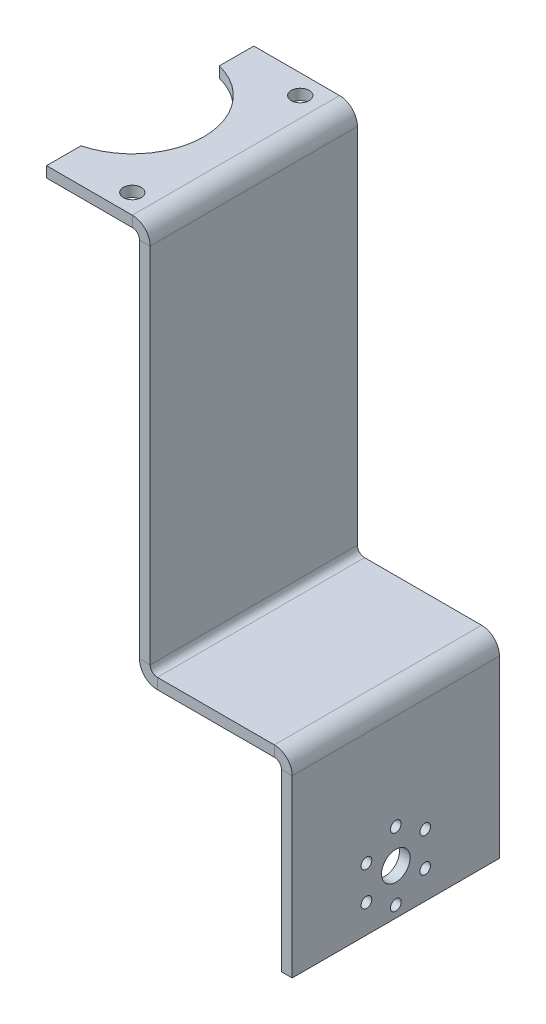
ISO-10303-21;
HEADER;
FILE_DESCRIPTION(('STEP AP214'),'2;1');
FILE_NAME('part.step','',(''),(''),'','','');
FILE_SCHEMA(('AUTOMOTIVE_DESIGN { 1 0 10303 214 1 1 1 1 }'));
ENDSEC;
DATA;
#1=APPLICATION_CONTEXT('core data for automotive mechanical design processes');
#2=APPLICATION_PROTOCOL_DEFINITION('international standard','automotive_design',2000,#1);
#3=PRODUCT_CONTEXT('',#1,'mechanical');
#4=PRODUCT('Part','Part','',(#3));
#5=PRODUCT_RELATED_PRODUCT_CATEGORY('part','',(#4));
#6=PRODUCT_DEFINITION_FORMATION('','',#4);
#7=PRODUCT_DEFINITION_CONTEXT('part definition',#1,'design');
#8=PRODUCT_DEFINITION('design','',#6,#7);
#9=PRODUCT_DEFINITION_SHAPE('','',#8);
#10=(LENGTH_UNIT() NAMED_UNIT(*) SI_UNIT(.MILLI.,.METRE.));
#11=(NAMED_UNIT(*) PLANE_ANGLE_UNIT() SI_UNIT($,.RADIAN.));
#12=(NAMED_UNIT(*) SI_UNIT($,.STERADIAN.) SOLID_ANGLE_UNIT());
#13=UNCERTAINTY_MEASURE_WITH_UNIT(LENGTH_MEASURE(1.E-05),#10,'distance_accuracy_value','');
#14=(GEOMETRIC_REPRESENTATION_CONTEXT(3) GLOBAL_UNCERTAINTY_ASSIGNED_CONTEXT((#13)) GLOBAL_UNIT_ASSIGNED_CONTEXT((#10,
#11,#12)) REPRESENTATION_CONTEXT('',''));
#15=CARTESIAN_POINT('',(0.,0.,0.));
#16=DIRECTION('',(0.,0.,1.));
#17=DIRECTION('',(1.,0.,0.));
#18=AXIS2_PLACEMENT_3D('',#15,#16,#17);
#19=CARTESIAN_POINT('',(0.,-3.,29.));
#20=DIRECTION('',(0.,1.,0.));
#21=DIRECTION('',(0.,0.,1.));
#22=AXIS2_PLACEMENT_3D('',#19,#20,#21);
#23=CYLINDRICAL_SURFACE('',#22,20.);
#24=CARTESIAN_POINT('',(0.,0.,29.));
#25=DIRECTION('',(0.,1.,0.));
#26=DIRECTION('',(0.,0.,1.));
#27=AXIS2_PLACEMENT_3D('',#24,#25,#26);
#28=CIRCLE('',#27,20.);
#29=CARTESIAN_POINT('',(5.,0.,48.3649167310371));
#30=VERTEX_POINT('',#29);
#31=CARTESIAN_POINT('',(5.,0.,9.63508326896292));
#32=VERTEX_POINT('',#31);
#33=EDGE_CURVE('E177',#30,#32,#28,.T.);
#34=ORIENTED_EDGE('',*,*,#33,.T.);
#35=DIRECTION('',(0.,-1.,0.));
#36=VECTOR('',#35,1.);
#37=CARTESIAN_POINT('',(5.,-3.,9.63508326896292));
#38=LINE('',#37,#36);
#39=CARTESIAN_POINT('',(5.,-3.,9.63508326896292));
#40=VERTEX_POINT('',#39);
#41=EDGE_CURVE('E162',#40,#32,#38,.F.);
#42=ORIENTED_EDGE('',*,*,#41,.F.);
#43=CARTESIAN_POINT('',(0.,-3.,29.));
#44=DIRECTION('',(0.,1.,0.));
#45=DIRECTION('',(0.,0.,1.));
#46=AXIS2_PLACEMENT_3D('',#43,#44,#45);
#47=CIRCLE('',#46,20.);
#48=CARTESIAN_POINT('',(5.,-3.,48.3649167310371));
#49=VERTEX_POINT('',#48);
#50=EDGE_CURVE('E319',#49,#40,#47,.T.);
#51=ORIENTED_EDGE('',*,*,#50,.F.);
#52=DIRECTION('',(0.,1.,0.));
#53=VECTOR('',#52,1.);
#54=CARTESIAN_POINT('',(5.,0.,48.3649167310371));
#55=LINE('',#54,#53);
#56=EDGE_CURVE('E62',#30,#49,#55,.F.);
#57=ORIENTED_EDGE('',*,*,#56,.F.);
#58=EDGE_LOOP('',(#34,#42,#51,#57));
#59=FACE_BOUND('',#58,.T.);
#60=ADVANCED_FACE('F39',(#59),#23,.F.);
#61=CARTESIAN_POINT('',(0.,0.,58.));
#62=DIRECTION('',(0.,1.,0.));
#63=DIRECTION('',(0.,0.,1.));
#64=AXIS2_PLACEMENT_3D('',#61,#62,#63);
#65=PLANE('',#64);
#66=CARTESIAN_POINT('',(23.5,0.,52.5));
#67=DIRECTION('',(0.,1.,0.));
#68=DIRECTION('',(0.,0.,1.));
#69=AXIS2_PLACEMENT_3D('',#66,#67,#68);
#70=CIRCLE('',#69,2.5);
#71=CARTESIAN_POINT('',(23.5,0.,55.));
#72=VERTEX_POINT('',#71);
#73=EDGE_CURVE('E185',#72,#72,#70,.T.);
#74=ORIENTED_EDGE('',*,*,#73,.F.);
#75=EDGE_LOOP('',(#74));
#76=FACE_BOUND('',#75,.T.);
#77=CARTESIAN_POINT('',(23.5,0.,5.5));
#78=DIRECTION('',(0.,1.,0.));
#79=DIRECTION('',(0.,0.,1.));
#80=AXIS2_PLACEMENT_3D('',#77,#78,#79);
#81=CIRCLE('',#80,2.5);
#82=CARTESIAN_POINT('',(23.5,0.,8.));
#83=VERTEX_POINT('',#82);
#84=EDGE_CURVE('E181',#83,#83,#81,.T.);
#85=ORIENTED_EDGE('',*,*,#84,.F.);
#86=EDGE_LOOP('',(#85));
#87=FACE_BOUND('',#86,.T.);
#88=DIRECTION('',(1.,0.,0.));
#89=VECTOR('',#88,1.);
#90=CARTESIAN_POINT('',(0.,0.,0.));
#91=LINE('',#90,#89);
#92=CARTESIAN_POINT('',(5.,0.,0.));
#93=VERTEX_POINT('',#92);
#94=CARTESIAN_POINT('',(29.,0.,0.));
#95=VERTEX_POINT('',#94);
#96=EDGE_CURVE('E179',#93,#95,#91,.T.);
#97=ORIENTED_EDGE('',*,*,#96,.F.);
#98=DIRECTION('',(0.,0.,1.));
#99=VECTOR('',#98,1.);
#100=CARTESIAN_POINT('',(5.,0.,58.));
#101=LINE('',#100,#99);
#102=EDGE_CURVE('E54',#32,#93,#101,.F.);
#103=ORIENTED_EDGE('',*,*,#102,.F.);
#104=ORIENTED_EDGE('',*,*,#33,.F.);
#105=DIRECTION('',(0.,0.,1.));
#106=VECTOR('',#105,1.);
#107=CARTESIAN_POINT('',(5.,0.,-13.));
#108=LINE('',#107,#106);
#109=CARTESIAN_POINT('',(5.,0.,58.));
#110=VERTEX_POINT('',#109);
#111=EDGE_CURVE('E933',#30,#110,#108,.T.);
#112=ORIENTED_EDGE('',*,*,#111,.T.);
#113=DIRECTION('',(1.,0.,0.));
#114=VECTOR('',#113,1.);
#115=CARTESIAN_POINT('',(0.,0.,58.));
#116=LINE('',#115,#114);
#117=CARTESIAN_POINT('',(29.,0.,58.));
#118=VERTEX_POINT('',#117);
#119=EDGE_CURVE('E334',#110,#118,#116,.T.);
#120=ORIENTED_EDGE('',*,*,#119,.T.);
#121=DIRECTION('',(0.,0.,1.));
#122=VECTOR('',#121,1.);
#123=CARTESIAN_POINT('',(29.,0.,58.));
#124=LINE('',#123,#122);
#125=EDGE_CURVE('E308',#95,#118,#124,.T.);
#126=ORIENTED_EDGE('',*,*,#125,.F.);
#127=EDGE_LOOP('',(#97,#103,#104,#112,#120,#126));
#128=FACE_BOUND('',#127,.T.);
#129=ADVANCED_FACE('F175',(#76,#87,#128),#65,.T.);
#130=CARTESIAN_POINT('',(0.,-3.,58.));
#131=DIRECTION('',(0.,1.,0.));
#132=DIRECTION('',(0.,0.,1.));
#133=AXIS2_PLACEMENT_3D('',#130,#131,#132);
#134=PLANE('',#133);
#135=CARTESIAN_POINT('',(23.5,-3.,52.5));
#136=DIRECTION('',(0.,1.,0.));
#137=DIRECTION('',(0.,0.,1.));
#138=AXIS2_PLACEMENT_3D('',#135,#136,#137);
#139=CIRCLE('',#138,2.5);
#140=CARTESIAN_POINT('',(23.5,-3.,55.));
#141=VERTEX_POINT('',#140);
#142=EDGE_CURVE('E329',#141,#141,#139,.T.);
#143=ORIENTED_EDGE('',*,*,#142,.T.);
#144=EDGE_LOOP('',(#143));
#145=FACE_BOUND('',#144,.T.);
#146=CARTESIAN_POINT('',(23.5,-3.,5.5));
#147=DIRECTION('',(0.,1.,0.));
#148=DIRECTION('',(0.,0.,1.));
#149=AXIS2_PLACEMENT_3D('',#146,#147,#148);
#150=CIRCLE('',#149,2.5);
#151=CARTESIAN_POINT('',(23.5,-3.,8.));
#152=VERTEX_POINT('',#151);
#153=EDGE_CURVE('E326',#152,#152,#150,.T.);
#154=ORIENTED_EDGE('',*,*,#153,.T.);
#155=EDGE_LOOP('',(#154));
#156=FACE_BOUND('',#155,.T.);
#157=DIRECTION('',(0.,0.,-1.));
#158=VECTOR('',#157,1.);
#159=CARTESIAN_POINT('',(5.,-3.,58.));
#160=LINE('',#159,#158);
#161=CARTESIAN_POINT('',(5.,-3.,0.));
#162=VERTEX_POINT('',#161);
#163=EDGE_CURVE('E165',#40,#162,#160,.T.);
#164=ORIENTED_EDGE('',*,*,#163,.T.);
#165=DIRECTION('',(1.,0.,0.));
#166=VECTOR('',#165,1.);
#167=CARTESIAN_POINT('',(0.,-3.,0.));
#168=LINE('',#167,#166);
#169=CARTESIAN_POINT('',(29.,-3.,0.));
#170=VERTEX_POINT('',#169);
#171=EDGE_CURVE('E324',#162,#170,#168,.T.);
#172=ORIENTED_EDGE('',*,*,#171,.T.);
#173=DIRECTION('',(0.,0.,1.));
#174=VECTOR('',#173,1.);
#175=CARTESIAN_POINT('',(29.,-3.,58.));
#176=LINE('',#175,#174);
#177=CARTESIAN_POINT('',(29.,-3.,58.));
#178=VERTEX_POINT('',#177);
#179=EDGE_CURVE('E321',#170,#178,#176,.T.);
#180=ORIENTED_EDGE('',*,*,#179,.T.);
#181=DIRECTION('',(1.,0.,0.));
#182=VECTOR('',#181,1.);
#183=CARTESIAN_POINT('',(0.,-3.,58.));
#184=LINE('',#183,#182);
#185=CARTESIAN_POINT('',(5.,-3.,58.));
#186=VERTEX_POINT('',#185);
#187=EDGE_CURVE('E332',#186,#178,#184,.T.);
#188=ORIENTED_EDGE('',*,*,#187,.F.);
#189=DIRECTION('',(0.,0.,1.));
#190=VECTOR('',#189,1.);
#191=CARTESIAN_POINT('',(5.,-3.,58.));
#192=LINE('',#191,#190);
#193=EDGE_CURVE('E931',#49,#186,#192,.T.);
#194=ORIENTED_EDGE('',*,*,#193,.F.);
#195=ORIENTED_EDGE('',*,*,#50,.T.);
#196=EDGE_LOOP('',(#164,#172,#180,#188,#194,#195));
#197=FACE_BOUND('',#196,.T.);
#198=ADVANCED_FACE('F346',(#145,#156,#197),#134,.F.);
#199=CARTESIAN_POINT('',(0.,-3.,0.));
#200=DIRECTION('',(0.,0.,1.));
#201=DIRECTION('',(1.,0.,0.));
#202=AXIS2_PLACEMENT_3D('',#199,#200,#201);
#203=PLANE('',#202);
#204=ORIENTED_EDGE('',*,*,#171,.F.);
#205=DIRECTION('',(0.,-1.,0.));
#206=VECTOR('',#205,1.);
#207=CARTESIAN_POINT('',(5.,-3.,0.));
#208=LINE('',#207,#206);
#209=EDGE_CURVE('E170',#162,#93,#208,.F.);
#210=ORIENTED_EDGE('',*,*,#209,.T.);
#211=ORIENTED_EDGE('',*,*,#96,.T.);
#212=DIRECTION('',(0.,-1.,0.));
#213=VECTOR('',#212,1.);
#214=CARTESIAN_POINT('',(29.,-3.,0.));
#215=LINE('',#214,#213);
#216=EDGE_CURVE('E336',#95,#170,#215,.T.);
#217=ORIENTED_EDGE('',*,*,#216,.T.);
#218=EDGE_LOOP('',(#204,#210,#211,#217));
#219=FACE_BOUND('',#218,.T.);
#220=ADVANCED_FACE('F497',(#219),#203,.F.);
#221=CARTESIAN_POINT('',(0.,-3.,58.));
#222=DIRECTION('',(0.,0.,1.));
#223=DIRECTION('',(1.,0.,0.));
#224=AXIS2_PLACEMENT_3D('',#221,#222,#223);
#225=PLANE('',#224);
#226=ORIENTED_EDGE('',*,*,#119,.F.);
#227=DIRECTION('',(0.,1.,0.));
#228=VECTOR('',#227,1.);
#229=CARTESIAN_POINT('',(5.,0.,58.));
#230=LINE('',#229,#228);
#231=EDGE_CURVE('E928',#110,#186,#230,.F.);
#232=ORIENTED_EDGE('',*,*,#231,.T.);
#233=ORIENTED_EDGE('',*,*,#187,.T.);
#234=DIRECTION('',(0.,-1.,0.));
#235=VECTOR('',#234,1.);
#236=CARTESIAN_POINT('',(29.,-3.,58.));
#237=LINE('',#236,#235);
#238=EDGE_CURVE('E302',#118,#178,#237,.T.);
#239=ORIENTED_EDGE('',*,*,#238,.F.);
#240=EDGE_LOOP('',(#226,#232,#233,#239));
#241=FACE_BOUND('',#240,.T.);
#242=ADVANCED_FACE('F509',(#241),#225,.T.);
#243=CARTESIAN_POINT('',(31.,-111.5,58.));
#244=DIRECTION('',(0.,0.,1.));
#245=DIRECTION('',(1.,0.,0.));
#246=AXIS2_PLACEMENT_3D('',#243,#244,#245);
#247=PLANE('',#246);
#248=DIRECTION('',(0.,-1.,0.));
#249=VECTOR('',#248,1.);
#250=CARTESIAN_POINT('',(68.75,-111.5,58.));
#251=LINE('',#250,#249);
#252=CARTESIAN_POINT('',(68.75,-108.5,58.));
#253=VERTEX_POINT('',#252);
#254=CARTESIAN_POINT('',(68.75,-111.5,58.));
#255=VERTEX_POINT('',#254);
#256=EDGE_CURVE('E11',#253,#255,#251,.T.);
#257=ORIENTED_EDGE('',*,*,#256,.F.);
#258=DIRECTION('',(1.,0.,0.));
#259=VECTOR('',#258,1.);
#260=CARTESIAN_POINT('',(31.,-108.5,58.));
#261=LINE('',#260,#259);
#262=CARTESIAN_POINT('',(36.,-108.5,58.));
#263=VERTEX_POINT('',#262);
#264=EDGE_CURVE('E198',#263,#253,#261,.T.);
#265=ORIENTED_EDGE('',*,*,#264,.F.);
#266=DIRECTION('',(0.,-1.,0.));
#267=VECTOR('',#266,1.);
#268=CARTESIAN_POINT('',(36.,-111.5,58.));
#269=LINE('',#268,#267);
#270=CARTESIAN_POINT('',(36.,-111.5,58.));
#271=VERTEX_POINT('',#270);
#272=EDGE_CURVE('E207',#263,#271,#269,.T.);
#273=ORIENTED_EDGE('',*,*,#272,.T.);
#274=DIRECTION('',(1.,0.,0.));
#275=VECTOR('',#274,1.);
#276=CARTESIAN_POINT('',(31.,-111.5,58.));
#277=LINE('',#276,#275);
#278=EDGE_CURVE('E197',#271,#255,#277,.T.);
#279=ORIENTED_EDGE('',*,*,#278,.T.);
#280=EDGE_LOOP('',(#257,#265,#273,#279));
#281=FACE_BOUND('',#280,.T.);
#282=ADVANCED_FACE('F41',(#281),#247,.T.);
#283=CARTESIAN_POINT('',(31.,-111.5,0.));
#284=DIRECTION('',(0.,0.,1.));
#285=DIRECTION('',(1.,0.,0.));
#286=AXIS2_PLACEMENT_3D('',#283,#284,#285);
#287=PLANE('',#286);
#288=DIRECTION('',(0.,-1.,0.));
#289=VECTOR('',#288,1.);
#290=CARTESIAN_POINT('',(36.,-111.5,0.));
#291=LINE('',#290,#289);
#292=CARTESIAN_POINT('',(36.,-108.5,0.));
#293=VERTEX_POINT('',#292);
#294=CARTESIAN_POINT('',(36.,-111.5,0.));
#295=VERTEX_POINT('',#294);
#296=EDGE_CURVE('E212',#293,#295,#291,.T.);
#297=ORIENTED_EDGE('',*,*,#296,.F.);
#298=DIRECTION('',(1.,0.,0.));
#299=VECTOR('',#298,1.);
#300=CARTESIAN_POINT('',(31.,-108.5,0.));
#301=LINE('',#300,#299);
#302=CARTESIAN_POINT('',(68.75,-108.5,0.));
#303=VERTEX_POINT('',#302);
#304=EDGE_CURVE('E201',#293,#303,#301,.T.);
#305=ORIENTED_EDGE('',*,*,#304,.T.);
#306=DIRECTION('',(0.,-1.,0.));
#307=VECTOR('',#306,1.);
#308=CARTESIAN_POINT('',(68.75,-111.5,0.));
#309=LINE('',#308,#307);
#310=CARTESIAN_POINT('',(68.75,-111.5,0.));
#311=VERTEX_POINT('',#310);
#312=EDGE_CURVE('E218',#303,#311,#309,.T.);
#313=ORIENTED_EDGE('',*,*,#312,.T.);
#314=DIRECTION('',(1.,0.,0.));
#315=VECTOR('',#314,1.);
#316=CARTESIAN_POINT('',(31.,-111.5,0.));
#317=LINE('',#316,#315);
#318=EDGE_CURVE('E195',#295,#311,#317,.T.);
#319=ORIENTED_EDGE('',*,*,#318,.F.);
#320=EDGE_LOOP('',(#297,#305,#313,#319));
#321=FACE_BOUND('',#320,.T.);
#322=ADVANCED_FACE('F248',(#321),#287,.F.);
#323=CARTESIAN_POINT('',(31.,-111.5,58.));
#324=DIRECTION('',(0.,1.,0.));
#325=DIRECTION('',(0.,0.,1.));
#326=AXIS2_PLACEMENT_3D('',#323,#324,#325);
#327=PLANE('',#326);
#328=ORIENTED_EDGE('',*,*,#278,.F.);
#329=DIRECTION('',(0.,0.,-1.));
#330=VECTOR('',#329,1.);
#331=CARTESIAN_POINT('',(36.,-111.5,58.));
#332=LINE('',#331,#330);
#333=EDGE_CURVE('E200',#271,#295,#332,.T.);
#334=ORIENTED_EDGE('',*,*,#333,.T.);
#335=ORIENTED_EDGE('',*,*,#318,.T.);
#336=DIRECTION('',(0.,0.,1.));
#337=VECTOR('',#336,1.);
#338=CARTESIAN_POINT('',(68.75,-111.5,58.));
#339=LINE('',#338,#337);
#340=EDGE_CURVE('E215',#311,#255,#339,.T.);
#341=ORIENTED_EDGE('',*,*,#340,.T.);
#342=EDGE_LOOP('',(#328,#334,#335,#341));
#343=FACE_BOUND('',#342,.T.);
#344=ADVANCED_FACE('F260',(#343),#327,.F.);
#345=CARTESIAN_POINT('',(31.,-108.5,58.));
#346=DIRECTION('',(0.,1.,0.));
#347=DIRECTION('',(0.,0.,1.));
#348=AXIS2_PLACEMENT_3D('',#345,#346,#347);
#349=PLANE('',#348);
#350=ORIENTED_EDGE('',*,*,#264,.T.);
#351=DIRECTION('',(0.,0.,1.));
#352=VECTOR('',#351,1.);
#353=CARTESIAN_POINT('',(68.75,-108.5,58.));
#354=LINE('',#353,#352);
#355=EDGE_CURVE('E47',#303,#253,#354,.T.);
#356=ORIENTED_EDGE('',*,*,#355,.F.);
#357=ORIENTED_EDGE('',*,*,#304,.F.);
#358=DIRECTION('',(0.,0.,-1.));
#359=VECTOR('',#358,1.);
#360=CARTESIAN_POINT('',(36.,-108.5,58.));
#361=LINE('',#360,#359);
#362=EDGE_CURVE('E210',#263,#293,#361,.T.);
#363=ORIENTED_EDGE('',*,*,#362,.F.);
#364=EDGE_LOOP('',(#350,#356,#357,#363));
#365=FACE_BOUND('',#364,.T.);
#366=ADVANCED_FACE('F234',(#365),#349,.T.);
#367=CARTESIAN_POINT('',(23.5,-3.,5.5));
#368=DIRECTION('',(0.,1.,0.));
#369=DIRECTION('',(0.,0.,1.));
#370=AXIS2_PLACEMENT_3D('',#367,#368,#369);
#371=CYLINDRICAL_SURFACE('',#370,2.5);
#372=ORIENTED_EDGE('',*,*,#153,.F.);
#373=EDGE_LOOP('',(#372));
#374=FACE_BOUND('',#373,.T.);
#375=ORIENTED_EDGE('',*,*,#84,.T.);
#376=EDGE_LOOP('',(#375));
#377=FACE_BOUND('',#376,.T.);
#378=ADVANCED_FACE('F350',(#374,#377),#371,.F.);
#379=CARTESIAN_POINT('',(23.5,-3.,52.5));
#380=DIRECTION('',(0.,1.,0.));
#381=DIRECTION('',(0.,0.,1.));
#382=AXIS2_PLACEMENT_3D('',#379,#380,#381);
#383=CYLINDRICAL_SURFACE('',#382,2.5);
#384=ORIENTED_EDGE('',*,*,#142,.F.);
#385=EDGE_LOOP('',(#384));
#386=FACE_BOUND('',#385,.T.);
#387=ORIENTED_EDGE('',*,*,#73,.T.);
#388=EDGE_LOOP('',(#387));
#389=FACE_BOUND('',#388,.T.);
#390=ADVANCED_FACE('F342',(#386,#389),#383,.F.);
#391=CARTESIAN_POINT('',(29.,-5.,0.));
#392=DIRECTION('',(0.,0.,1.));
#393=DIRECTION('',(0.,-1.,0.));
#394=AXIS2_PLACEMENT_3D('',#391,#392,#393);
#395=PLANE('',#394);
#396=ORIENTED_EDGE('',*,*,#216,.F.);
#397=CARTESIAN_POINT('',(29.,-5.,0.));
#398=DIRECTION('',(0.,0.,1.));
#399=DIRECTION('',(1.,0.,0.));
#400=AXIS2_PLACEMENT_3D('',#397,#398,#399);
#401=CIRCLE('',#400,5.);
#402=CARTESIAN_POINT('',(34.,-5.,0.));
#403=VERTEX_POINT('',#402);
#404=EDGE_CURVE('E316',#95,#403,#401,.F.);
#405=ORIENTED_EDGE('',*,*,#404,.T.);
#406=DIRECTION('',(-1.,0.,0.));
#407=VECTOR('',#406,1.);
#408=CARTESIAN_POINT('',(31.,-5.,0.));
#409=LINE('',#408,#407);
#410=CARTESIAN_POINT('',(31.,-5.,0.));
#411=VERTEX_POINT('',#410);
#412=EDGE_CURVE('E313',#403,#411,#409,.T.);
#413=ORIENTED_EDGE('',*,*,#412,.T.);
#414=CARTESIAN_POINT('',(29.,-5.,0.));
#415=DIRECTION('',(0.,0.,-1.));
#416=DIRECTION('',(0.,1.,0.));
#417=AXIS2_PLACEMENT_3D('',#414,#415,#416);
#418=CIRCLE('',#417,2.);
#419=EDGE_CURVE('E297',#170,#411,#418,.T.);
#420=ORIENTED_EDGE('',*,*,#419,.F.);
#421=EDGE_LOOP('',(#396,#405,#413,#420));
#422=FACE_BOUND('',#421,.T.);
#423=ADVANCED_FACE('F358',(#422),#395,.F.);
#424=CARTESIAN_POINT('',(29.,-5.,-29.3371722273058));
#425=DIRECTION('',(0.,0.,1.));
#426=DIRECTION('',(1.,0.,0.));
#427=AXIS2_PLACEMENT_3D('',#424,#425,#426);
#428=CYLINDRICAL_SURFACE('',#427,5.);
#429=CARTESIAN_POINT('',(29.,-5.,57.9999999999999));
#430=DIRECTION('',(0.,0.,1.));
#431=DIRECTION('',(1.,0.,0.));
#432=AXIS2_PLACEMENT_3D('',#429,#430,#431);
#433=CIRCLE('',#432,5.);
#434=CARTESIAN_POINT('',(34.,-5.,57.9999999999999));
#435=VERTEX_POINT('',#434);
#436=EDGE_CURVE('E305',#435,#118,#433,.T.);
#437=ORIENTED_EDGE('',*,*,#436,.F.);
#438=DIRECTION('',(0.,0.,-1.));
#439=VECTOR('',#438,1.);
#440=CARTESIAN_POINT('',(34.,-5.,58.));
#441=LINE('',#440,#439);
#442=EDGE_CURVE('E311',#435,#403,#441,.T.);
#443=ORIENTED_EDGE('',*,*,#442,.T.);
#444=ORIENTED_EDGE('',*,*,#404,.F.);
#445=ORIENTED_EDGE('',*,*,#125,.T.);
#446=EDGE_LOOP('',(#437,#443,#444,#445));
#447=FACE_BOUND('',#446,.T.);
#448=ADVANCED_FACE('F569',(#447),#428,.T.);
#449=CARTESIAN_POINT('',(29.,-5.,58.));
#450=DIRECTION('',(0.,0.,-1.));
#451=DIRECTION('',(-1.,0.,0.));
#452=AXIS2_PLACEMENT_3D('',#449,#450,#451);
#453=PLANE('',#452);
#454=DIRECTION('',(-1.,0.,0.));
#455=VECTOR('',#454,1.);
#456=CARTESIAN_POINT('',(31.,-5.,58.));
#457=LINE('',#456,#455);
#458=CARTESIAN_POINT('',(31.,-5.,58.));
#459=VERTEX_POINT('',#458);
#460=EDGE_CURVE('E286',#435,#459,#457,.T.);
#461=ORIENTED_EDGE('',*,*,#460,.F.);
#462=ORIENTED_EDGE('',*,*,#436,.T.);
#463=ORIENTED_EDGE('',*,*,#238,.T.);
#464=CARTESIAN_POINT('',(29.,-5.,58.));
#465=DIRECTION('',(0.,0.,1.));
#466=DIRECTION('',(1.,0.,0.));
#467=AXIS2_PLACEMENT_3D('',#464,#465,#466);
#468=CIRCLE('',#467,2.);
#469=EDGE_CURVE('E299',#459,#178,#468,.T.);
#470=ORIENTED_EDGE('',*,*,#469,.F.);
#471=EDGE_LOOP('',(#461,#462,#463,#470));
#472=FACE_BOUND('',#471,.T.);
#473=ADVANCED_FACE('F560',(#472),#453,.F.);
#474=CARTESIAN_POINT('',(29.,-5.,-29.3371722273058));
#475=DIRECTION('',(0.,0.,1.));
#476=DIRECTION('',(1.,0.,0.));
#477=AXIS2_PLACEMENT_3D('',#474,#475,#476);
#478=CYLINDRICAL_SURFACE('',#477,2.);
#479=ORIENTED_EDGE('',*,*,#469,.T.);
#480=ORIENTED_EDGE('',*,*,#179,.F.);
#481=ORIENTED_EDGE('',*,*,#419,.T.);
#482=DIRECTION('',(0.,0.,-1.));
#483=VECTOR('',#482,1.);
#484=CARTESIAN_POINT('',(31.,-5.,0.));
#485=LINE('',#484,#483);
#486=EDGE_CURVE('E289',#459,#411,#485,.T.);
#487=ORIENTED_EDGE('',*,*,#486,.F.);
#488=EDGE_LOOP('',(#479,#480,#481,#487));
#489=FACE_BOUND('',#488,.T.);
#490=ADVANCED_FACE('F555',(#489),#478,.F.);
#491=CARTESIAN_POINT('',(31.,-3.,58.));
#492=DIRECTION('',(1.,0.,0.));
#493=DIRECTION('',(0.,0.,-1.));
#494=AXIS2_PLACEMENT_3D('',#491,#492,#493);
#495=PLANE('',#494);
#496=DIRECTION('',(0.,-1.,0.));
#497=VECTOR('',#496,1.);
#498=CARTESIAN_POINT('',(31.,-3.,0.));
#499=LINE('',#498,#497);
#500=CARTESIAN_POINT('',(31.,-106.5,0.));
#501=VERTEX_POINT('',#500);
#502=EDGE_CURVE('E295',#411,#501,#499,.T.);
#503=ORIENTED_EDGE('',*,*,#502,.T.);
#504=DIRECTION('',(0.,0.,1.));
#505=VECTOR('',#504,1.);
#506=CARTESIAN_POINT('',(31.,-106.5,58.));
#507=LINE('',#506,#505);
#508=CARTESIAN_POINT('',(31.,-106.5,58.));
#509=VERTEX_POINT('',#508);
#510=EDGE_CURVE('E292',#501,#509,#507,.T.);
#511=ORIENTED_EDGE('',*,*,#510,.T.);
#512=DIRECTION('',(0.,-1.,0.));
#513=VECTOR('',#512,1.);
#514=CARTESIAN_POINT('',(31.,-3.,58.));
#515=LINE('',#514,#513);
#516=EDGE_CURVE('E284',#459,#509,#515,.T.);
#517=ORIENTED_EDGE('',*,*,#516,.F.);
#518=ORIENTED_EDGE('',*,*,#486,.T.);
#519=EDGE_LOOP('',(#503,#511,#517,#518));
#520=FACE_BOUND('',#519,.T.);
#521=ADVANCED_FACE('F559',(#520),#495,.F.);
#522=CARTESIAN_POINT('',(31.,-3.,58.));
#523=DIRECTION('',(0.,0.,1.));
#524=DIRECTION('',(0.,-1.,0.));
#525=AXIS2_PLACEMENT_3D('',#522,#523,#524);
#526=PLANE('',#525);
#527=DIRECTION('',(-1.,0.,0.));
#528=VECTOR('',#527,1.);
#529=CARTESIAN_POINT('',(31.,-106.5,58.));
#530=LINE('',#529,#528);
#531=CARTESIAN_POINT('',(34.,-106.5,58.));
#532=VERTEX_POINT('',#531);
#533=EDGE_CURVE('E182',#532,#509,#530,.T.);
#534=ORIENTED_EDGE('',*,*,#533,.F.);
#535=DIRECTION('',(0.,1.,0.));
#536=VECTOR('',#535,1.);
#537=CARTESIAN_POINT('',(34.,-3.,58.));
#538=LINE('',#537,#536);
#539=EDGE_CURVE('E282',#435,#532,#538,.F.);
#540=ORIENTED_EDGE('',*,*,#539,.F.);
#541=ORIENTED_EDGE('',*,*,#460,.T.);
#542=ORIENTED_EDGE('',*,*,#516,.T.);
#543=EDGE_LOOP('',(#534,#540,#541,#542));
#544=FACE_BOUND('',#543,.T.);
#545=ADVANCED_FACE('F638',(#544),#526,.T.);
#546=CARTESIAN_POINT('',(34.,-3.,58.));
#547=DIRECTION('',(1.,0.,0.));
#548=DIRECTION('',(0.,0.,-1.));
#549=AXIS2_PLACEMENT_3D('',#546,#547,#548);
#550=PLANE('',#549);
#551=DIRECTION('',(0.,1.,0.));
#552=VECTOR('',#551,1.);
#553=CARTESIAN_POINT('',(34.,-3.,0.));
#554=LINE('',#553,#552);
#555=CARTESIAN_POINT('',(34.,-106.5,0.));
#556=VERTEX_POINT('',#555);
#557=EDGE_CURVE('E280',#403,#556,#554,.F.);
#558=ORIENTED_EDGE('',*,*,#557,.F.);
#559=ORIENTED_EDGE('',*,*,#442,.F.);
#560=ORIENTED_EDGE('',*,*,#539,.T.);
#561=DIRECTION('',(0.,0.,1.));
#562=VECTOR('',#561,1.);
#563=CARTESIAN_POINT('',(34.,-106.5,58.));
#564=LINE('',#563,#562);
#565=EDGE_CURVE('E188',#556,#532,#564,.T.);
#566=ORIENTED_EDGE('',*,*,#565,.F.);
#567=EDGE_LOOP('',(#558,#559,#560,#566));
#568=FACE_BOUND('',#567,.T.);
#569=ADVANCED_FACE('F627',(#568),#550,.T.);
#570=CARTESIAN_POINT('',(31.,-3.,0.));
#571=DIRECTION('',(0.,0.,1.));
#572=DIRECTION('',(0.,-1.,0.));
#573=AXIS2_PLACEMENT_3D('',#570,#571,#572);
#574=PLANE('',#573);
#575=ORIENTED_EDGE('',*,*,#412,.F.);
#576=ORIENTED_EDGE('',*,*,#557,.T.);
#577=DIRECTION('',(-1.,0.,0.));
#578=VECTOR('',#577,1.);
#579=CARTESIAN_POINT('',(31.,-106.5,0.));
#580=LINE('',#579,#578);
#581=EDGE_CURVE('E203',#556,#501,#580,.T.);
#582=ORIENTED_EDGE('',*,*,#581,.T.);
#583=ORIENTED_EDGE('',*,*,#502,.F.);
#584=EDGE_LOOP('',(#575,#576,#582,#583));
#585=FACE_BOUND('',#584,.T.);
#586=ADVANCED_FACE('F371',(#585),#574,.F.);
#587=CARTESIAN_POINT('',(36.,-106.5,0.));
#588=DIRECTION('',(0.,0.,-1.));
#589=DIRECTION('',(-1.,0.,0.));
#590=AXIS2_PLACEMENT_3D('',#587,#588,#589);
#591=PLANE('',#590);
#592=ORIENTED_EDGE('',*,*,#581,.F.);
#593=CARTESIAN_POINT('',(36.,-106.5,0.));
#594=DIRECTION('',(0.,0.,1.));
#595=DIRECTION('',(1.,0.,0.));
#596=AXIS2_PLACEMENT_3D('',#593,#594,#595);
#597=CIRCLE('',#596,2.);
#598=EDGE_CURVE('E257',#556,#293,#597,.T.);
#599=ORIENTED_EDGE('',*,*,#598,.T.);
#600=ORIENTED_EDGE('',*,*,#296,.T.);
#601=CARTESIAN_POINT('',(36.,-106.5,0.));
#602=DIRECTION('',(0.,0.,1.));
#603=DIRECTION('',(1.,0.,0.));
#604=AXIS2_PLACEMENT_3D('',#601,#602,#603);
#605=CIRCLE('',#604,5.);
#606=EDGE_CURVE('E254',#501,#295,#605,.T.);
#607=ORIENTED_EDGE('',*,*,#606,.F.);
#608=EDGE_LOOP('',(#592,#599,#600,#607));
#609=FACE_BOUND('',#608,.T.);
#610=ADVANCED_FACE('F253',(#609),#591,.T.);
#611=CARTESIAN_POINT('',(36.,-106.5,58.));
#612=DIRECTION('',(0.,0.,1.));
#613=DIRECTION('',(1.,0.,0.));
#614=AXIS2_PLACEMENT_3D('',#611,#612,#613);
#615=PLANE('',#614);
#616=ORIENTED_EDGE('',*,*,#272,.F.);
#617=CARTESIAN_POINT('',(36.,-106.5,58.));
#618=DIRECTION('',(0.,0.,1.));
#619=DIRECTION('',(1.,0.,0.));
#620=AXIS2_PLACEMENT_3D('',#617,#618,#619);
#621=CIRCLE('',#620,2.);
#622=EDGE_CURVE('E271',#263,#532,#621,.F.);
#623=ORIENTED_EDGE('',*,*,#622,.T.);
#624=ORIENTED_EDGE('',*,*,#533,.T.);
#625=CARTESIAN_POINT('',(36.,-106.5,58.));
#626=DIRECTION('',(0.,0.,-1.));
#627=DIRECTION('',(-1.,0.,0.));
#628=AXIS2_PLACEMENT_3D('',#625,#626,#627);
#629=CIRCLE('',#628,5.);
#630=EDGE_CURVE('E194',#271,#509,#629,.T.);
#631=ORIENTED_EDGE('',*,*,#630,.F.);
#632=EDGE_LOOP('',(#616,#623,#624,#631));
#633=FACE_BOUND('',#632,.T.);
#634=ADVANCED_FACE('F266',(#633),#615,.T.);
#635=CARTESIAN_POINT('',(36.,-106.5,-29.3371722273058));
#636=DIRECTION('',(0.,0.,1.));
#637=DIRECTION('',(1.,0.,0.));
#638=AXIS2_PLACEMENT_3D('',#635,#636,#637);
#639=CYLINDRICAL_SURFACE('',#638,5.);
#640=ORIENTED_EDGE('',*,*,#630,.T.);
#641=ORIENTED_EDGE('',*,*,#510,.F.);
#642=ORIENTED_EDGE('',*,*,#606,.T.);
#643=ORIENTED_EDGE('',*,*,#333,.F.);
#644=EDGE_LOOP('',(#640,#641,#642,#643));
#645=FACE_BOUND('',#644,.T.);
#646=ADVANCED_FACE('F264',(#645),#639,.T.);
#647=CARTESIAN_POINT('',(36.,-106.5,-29.3371722273058));
#648=DIRECTION('',(0.,0.,1.));
#649=DIRECTION('',(1.,0.,0.));
#650=AXIS2_PLACEMENT_3D('',#647,#648,#649);
#651=CYLINDRICAL_SURFACE('',#650,2.);
#652=ORIENTED_EDGE('',*,*,#622,.F.);
#653=ORIENTED_EDGE('',*,*,#362,.T.);
#654=ORIENTED_EDGE('',*,*,#598,.F.);
#655=ORIENTED_EDGE('',*,*,#565,.T.);
#656=EDGE_LOOP('',(#652,#653,#654,#655));
#657=FACE_BOUND('',#656,.T.);
#658=ADVANCED_FACE('F374',(#657),#651,.F.);
#659=CARTESIAN_POINT('',(68.75,-113.5,0.));
#660=DIRECTION('',(0.,0.,1.));
#661=DIRECTION('',(1.,0.,0.));
#662=AXIS2_PLACEMENT_3D('',#659,#660,#661);
#663=PLANE('',#662);
#664=ORIENTED_EDGE('',*,*,#312,.F.);
#665=CARTESIAN_POINT('',(68.75,-113.5,0.));
#666=DIRECTION('',(0.,0.,1.));
#667=DIRECTION('',(1.,0.,0.));
#668=AXIS2_PLACEMENT_3D('',#665,#666,#667);
#669=CIRCLE('',#668,5.);
#670=CARTESIAN_POINT('',(73.75,-113.5,0.));
#671=VERTEX_POINT('',#670);
#672=EDGE_CURVE('E230',#303,#671,#669,.F.);
#673=ORIENTED_EDGE('',*,*,#672,.T.);
#674=DIRECTION('',(-1.,0.,0.));
#675=VECTOR('',#674,1.);
#676=CARTESIAN_POINT('',(70.75,-113.5,0.));
#677=LINE('',#676,#675);
#678=CARTESIAN_POINT('',(70.75,-113.5,0.));
#679=VERTEX_POINT('',#678);
#680=EDGE_CURVE('E860',#671,#679,#677,.T.);
#681=ORIENTED_EDGE('',*,*,#680,.T.);
#682=CARTESIAN_POINT('',(68.75,-113.5,0.));
#683=DIRECTION('',(0.,0.,-1.));
#684=DIRECTION('',(-1.,0.,0.));
#685=AXIS2_PLACEMENT_3D('',#682,#683,#684);
#686=CIRCLE('',#685,2.);
#687=EDGE_CURVE('E244',#311,#679,#686,.T.);
#688=ORIENTED_EDGE('',*,*,#687,.F.);
#689=EDGE_LOOP('',(#664,#673,#681,#688));
#690=FACE_BOUND('',#689,.T.);
#691=ADVANCED_FACE('F241',(#690),#663,.F.);
#692=CARTESIAN_POINT('',(68.75,-113.5,58.));
#693=DIRECTION('',(0.,0.,-1.));
#694=DIRECTION('',(-1.,0.,0.));
#695=AXIS2_PLACEMENT_3D('',#692,#693,#694);
#696=PLANE('',#695);
#697=DIRECTION('',(-1.,0.,0.));
#698=VECTOR('',#697,1.);
#699=CARTESIAN_POINT('',(70.75,-113.5,58.));
#700=LINE('',#699,#698);
#701=CARTESIAN_POINT('',(73.75,-113.5,58.));
#702=VERTEX_POINT('',#701);
#703=CARTESIAN_POINT('',(70.75,-113.5,58.));
#704=VERTEX_POINT('',#703);
#705=EDGE_CURVE('E852',#702,#704,#700,.T.);
#706=ORIENTED_EDGE('',*,*,#705,.F.);
#707=CARTESIAN_POINT('',(68.75,-113.5,57.9999999999999));
#708=DIRECTION('',(0.,0.,1.));
#709=DIRECTION('',(1.,0.,0.));
#710=AXIS2_PLACEMENT_3D('',#707,#708,#709);
#711=CIRCLE('',#710,5.);
#712=EDGE_CURVE('E228',#702,#253,#711,.T.);
#713=ORIENTED_EDGE('',*,*,#712,.T.);
#714=ORIENTED_EDGE('',*,*,#256,.T.);
#715=CARTESIAN_POINT('',(68.75,-113.5,58.));
#716=DIRECTION('',(0.,0.,1.));
#717=DIRECTION('',(1.,0.,0.));
#718=AXIS2_PLACEMENT_3D('',#715,#716,#717);
#719=CIRCLE('',#718,2.);
#720=EDGE_CURVE('E277',#704,#255,#719,.T.);
#721=ORIENTED_EDGE('',*,*,#720,.F.);
#722=EDGE_LOOP('',(#706,#713,#714,#721));
#723=FACE_BOUND('',#722,.T.);
#724=ADVANCED_FACE('F382',(#723),#696,.F.);
#725=CARTESIAN_POINT('',(68.75,-113.5,-29.3371722273058));
#726=DIRECTION('',(0.,0.,1.));
#727=DIRECTION('',(1.,0.,0.));
#728=AXIS2_PLACEMENT_3D('',#725,#726,#727);
#729=CYLINDRICAL_SURFACE('',#728,2.);
#730=ORIENTED_EDGE('',*,*,#720,.T.);
#731=ORIENTED_EDGE('',*,*,#340,.F.);
#732=ORIENTED_EDGE('',*,*,#687,.T.);
#733=DIRECTION('',(0.,0.,-1.));
#734=VECTOR('',#733,1.);
#735=CARTESIAN_POINT('',(70.75,-113.5,0.));
#736=LINE('',#735,#734);
#737=EDGE_CURVE('E868',#704,#679,#736,.T.);
#738=ORIENTED_EDGE('',*,*,#737,.F.);
#739=EDGE_LOOP('',(#730,#731,#732,#738));
#740=FACE_BOUND('',#739,.T.);
#741=ADVANCED_FACE('F385',(#740),#729,.F.);
#742=CARTESIAN_POINT('',(68.75,-113.5,-29.3371722273058));
#743=DIRECTION('',(0.,0.,1.));
#744=DIRECTION('',(1.,0.,0.));
#745=AXIS2_PLACEMENT_3D('',#742,#743,#744);
#746=CYLINDRICAL_SURFACE('',#745,5.);
#747=ORIENTED_EDGE('',*,*,#712,.F.);
#748=DIRECTION('',(0.,0.,-1.));
#749=VECTOR('',#748,1.);
#750=CARTESIAN_POINT('',(73.75,-113.5,58.));
#751=LINE('',#750,#749);
#752=EDGE_CURVE('E858',#702,#671,#751,.T.);
#753=ORIENTED_EDGE('',*,*,#752,.T.);
#754=ORIENTED_EDGE('',*,*,#672,.F.);
#755=ORIENTED_EDGE('',*,*,#355,.T.);
#756=EDGE_LOOP('',(#747,#753,#754,#755));
#757=FACE_BOUND('',#756,.T.);
#758=ADVANCED_FACE('F225',(#757),#746,.T.);
#759=CARTESIAN_POINT('',(70.75,-162.5,58.));
#760=DIRECTION('',(0.,-1.,0.));
#761=DIRECTION('',(0.,0.,-1.));
#762=AXIS2_PLACEMENT_3D('',#759,#760,#761);
#763=PLANE('',#762);
#764=DIRECTION('',(-1.,0.,0.));
#765=VECTOR('',#764,1.);
#766=CARTESIAN_POINT('',(70.75,-162.5,0.));
#767=LINE('',#766,#765);
#768=CARTESIAN_POINT('',(73.75,-162.5,0.));
#769=VERTEX_POINT('',#768);
#770=CARTESIAN_POINT('',(70.75,-162.5,0.));
#771=VERTEX_POINT('',#770);
#772=EDGE_CURVE('E876',#769,#771,#767,.T.);
#773=ORIENTED_EDGE('',*,*,#772,.F.);
#774=DIRECTION('',(0.,0.,-1.));
#775=VECTOR('',#774,1.);
#776=CARTESIAN_POINT('',(73.75,-162.5,58.));
#777=LINE('',#776,#775);
#778=CARTESIAN_POINT('',(73.75,-162.5,58.));
#779=VERTEX_POINT('',#778);
#780=EDGE_CURVE('E881',#779,#769,#777,.T.);
#781=ORIENTED_EDGE('',*,*,#780,.F.);
#782=DIRECTION('',(-1.,0.,0.));
#783=VECTOR('',#782,1.);
#784=CARTESIAN_POINT('',(70.75,-162.5,58.));
#785=LINE('',#784,#783);
#786=CARTESIAN_POINT('',(70.75,-162.5,58.));
#787=VERTEX_POINT('',#786);
#788=EDGE_CURVE('E863',#779,#787,#785,.T.);
#789=ORIENTED_EDGE('',*,*,#788,.T.);
#790=DIRECTION('',(0.,0.,-1.));
#791=VECTOR('',#790,1.);
#792=CARTESIAN_POINT('',(70.75,-162.5,58.));
#793=LINE('',#792,#791);
#794=EDGE_CURVE('E865',#787,#771,#793,.T.);
#795=ORIENTED_EDGE('',*,*,#794,.T.);
#796=EDGE_LOOP('',(#773,#781,#789,#795));
#797=FACE_BOUND('',#796,.T.);
#798=ADVANCED_FACE('F389',(#797),#763,.T.);
#799=CARTESIAN_POINT('',(70.75,-111.5,58.));
#800=DIRECTION('',(1.,0.,0.));
#801=DIRECTION('',(0.,0.,-1.));
#802=AXIS2_PLACEMENT_3D('',#799,#800,#801);
#803=PLANE('',#802);
#804=CARTESIAN_POINT('',(70.75,-145.05,37.227241335952));
#805=DIRECTION('',(1.,0.,0.));
#806=DIRECTION('',(0.,0.,-1.));
#807=AXIS2_PLACEMENT_3D('',#804,#805,#806);
#808=CIRCLE('',#807,1.5);
#809=CARTESIAN_POINT('',(70.75,-145.05,35.727241335952));
#810=VERTEX_POINT('',#809);
#811=EDGE_CURVE('E922',#810,#810,#808,.T.);
#812=ORIENTED_EDGE('',*,*,#811,.T.);
#813=EDGE_LOOP('',(#812));
#814=FACE_BOUND('',#813,.T.);
#815=CARTESIAN_POINT('',(70.75,-154.55,37.2272413359518));
#816=DIRECTION('',(1.,0.,0.));
#817=DIRECTION('',(0.,0.,-1.));
#818=AXIS2_PLACEMENT_3D('',#815,#816,#817);
#819=CIRCLE('',#818,1.49999999999999);
#820=CARTESIAN_POINT('',(70.75,-154.55,35.7272413359519));
#821=VERTEX_POINT('',#820);
#822=EDGE_CURVE('E916',#821,#821,#819,.T.);
#823=ORIENTED_EDGE('',*,*,#822,.T.);
#824=EDGE_LOOP('',(#823));
#825=FACE_BOUND('',#824,.T.);
#826=CARTESIAN_POINT('',(70.75,-159.3,28.9999999999996));
#827=DIRECTION('',(1.,0.,0.));
#828=DIRECTION('',(0.,0.,-1.));
#829=AXIS2_PLACEMENT_3D('',#826,#827,#828);
#830=CIRCLE('',#829,1.50000000000001);
#831=CARTESIAN_POINT('',(70.75,-159.3,27.4999999999996));
#832=VERTEX_POINT('',#831);
#833=EDGE_CURVE('E910',#832,#832,#830,.T.);
#834=ORIENTED_EDGE('',*,*,#833,.T.);
#835=EDGE_LOOP('',(#834));
#836=FACE_BOUND('',#835,.T.);
#837=CARTESIAN_POINT('',(70.75,-154.55,20.7727586640475));
#838=DIRECTION('',(1.,0.,0.));
#839=DIRECTION('',(0.,0.,-1.));
#840=AXIS2_PLACEMENT_3D('',#837,#838,#839);
#841=CIRCLE('',#840,1.50000000000003);
#842=CARTESIAN_POINT('',(70.75,-154.55,19.2727586640475));
#843=VERTEX_POINT('',#842);
#844=EDGE_CURVE('E904',#843,#843,#841,.T.);
#845=ORIENTED_EDGE('',*,*,#844,.T.);
#846=EDGE_LOOP('',(#845));
#847=FACE_BOUND('',#846,.T.);
#848=CARTESIAN_POINT('',(70.75,-145.05,20.7727586640477));
#849=DIRECTION('',(1.,0.,0.));
#850=DIRECTION('',(0.,0.,-1.));
#851=AXIS2_PLACEMENT_3D('',#848,#849,#850);
#852=CIRCLE('',#851,1.50000000000003);
#853=CARTESIAN_POINT('',(70.75,-145.05,19.2727586640477));
#854=VERTEX_POINT('',#853);
#855=EDGE_CURVE('E898',#854,#854,#852,.T.);
#856=ORIENTED_EDGE('',*,*,#855,.T.);
#857=EDGE_LOOP('',(#856));
#858=FACE_BOUND('',#857,.T.);
#859=CARTESIAN_POINT('',(70.75,-140.3,29.));
#860=DIRECTION('',(1.,0.,0.));
#861=DIRECTION('',(0.,0.,-1.));
#862=AXIS2_PLACEMENT_3D('',#859,#860,#861);
#863=CIRCLE('',#862,1.5);
#864=CARTESIAN_POINT('',(70.75,-140.3,27.5));
#865=VERTEX_POINT('',#864);
#866=EDGE_CURVE('E892',#865,#865,#863,.T.);
#867=ORIENTED_EDGE('',*,*,#866,.T.);
#868=EDGE_LOOP('',(#867));
#869=FACE_BOUND('',#868,.T.);
#870=CARTESIAN_POINT('',(70.75,-149.8,29.));
#871=DIRECTION('',(1.,0.,0.));
#872=DIRECTION('',(0.,0.,-1.));
#873=AXIS2_PLACEMENT_3D('',#870,#871,#872);
#874=CIRCLE('',#873,4.);
#875=CARTESIAN_POINT('',(70.75,-149.8,25.));
#876=VERTEX_POINT('',#875);
#877=EDGE_CURVE('E861',#876,#876,#874,.T.);
#878=ORIENTED_EDGE('',*,*,#877,.T.);
#879=EDGE_LOOP('',(#878));
#880=FACE_BOUND('',#879,.T.);
#881=DIRECTION('',(0.,-1.,0.));
#882=VECTOR('',#881,1.);
#883=CARTESIAN_POINT('',(70.75,-111.5,58.));
#884=LINE('',#883,#882);
#885=EDGE_CURVE('E855',#704,#787,#884,.T.);
#886=ORIENTED_EDGE('',*,*,#885,.F.);
#887=ORIENTED_EDGE('',*,*,#737,.T.);
#888=DIRECTION('',(0.,-1.,0.));
#889=VECTOR('',#888,1.);
#890=CARTESIAN_POINT('',(70.75,-111.5,0.));
#891=LINE('',#890,#889);
#892=EDGE_CURVE('E870',#679,#771,#891,.T.);
#893=ORIENTED_EDGE('',*,*,#892,.T.);
#894=ORIENTED_EDGE('',*,*,#794,.F.);
#895=EDGE_LOOP('',(#886,#887,#893,#894));
#896=FACE_BOUND('',#895,.T.);
#897=ADVANCED_FACE('F405',(#814,#825,#836,#847,#858,#869,#880,#896),#803,.F.);
#898=CARTESIAN_POINT('',(70.75,-111.5,0.));
#899=DIRECTION('',(0.,0.,1.));
#900=DIRECTION('',(0.,-1.,0.));
#901=AXIS2_PLACEMENT_3D('',#898,#899,#900);
#902=PLANE('',#901);
#903=ORIENTED_EDGE('',*,*,#680,.F.);
#904=DIRECTION('',(0.,1.,0.));
#905=VECTOR('',#904,1.);
#906=CARTESIAN_POINT('',(73.75,-111.5,0.));
#907=LINE('',#906,#905);
#908=EDGE_CURVE('E873',#671,#769,#907,.F.);
#909=ORIENTED_EDGE('',*,*,#908,.T.);
#910=ORIENTED_EDGE('',*,*,#772,.T.);
#911=ORIENTED_EDGE('',*,*,#892,.F.);
#912=EDGE_LOOP('',(#903,#909,#910,#911));
#913=FACE_BOUND('',#912,.T.);
#914=ADVANCED_FACE('F401',(#913),#902,.F.);
#915=CARTESIAN_POINT('',(73.75,-111.5,58.));
#916=DIRECTION('',(1.,0.,0.));
#917=DIRECTION('',(0.,0.,-1.));
#918=AXIS2_PLACEMENT_3D('',#915,#916,#917);
#919=PLANE('',#918);
#920=CARTESIAN_POINT('',(73.75,-145.05,37.227241335952));
#921=DIRECTION('',(1.,0.,0.));
#922=DIRECTION('',(0.,0.,-1.));
#923=AXIS2_PLACEMENT_3D('',#920,#921,#922);
#924=CIRCLE('',#923,1.5);
#925=CARTESIAN_POINT('',(73.75,-145.05,35.727241335952));
#926=VERTEX_POINT('',#925);
#927=EDGE_CURVE('E925',#926,#926,#924,.T.);
#928=ORIENTED_EDGE('',*,*,#927,.F.);
#929=EDGE_LOOP('',(#928));
#930=FACE_BOUND('',#929,.T.);
#931=CARTESIAN_POINT('',(73.75,-154.55,37.2272413359518));
#932=DIRECTION('',(1.,0.,0.));
#933=DIRECTION('',(0.,0.,-1.));
#934=AXIS2_PLACEMENT_3D('',#931,#932,#933);
#935=CIRCLE('',#934,1.49999999999999);
#936=CARTESIAN_POINT('',(73.75,-154.55,35.7272413359519));
#937=VERTEX_POINT('',#936);
#938=EDGE_CURVE('E919',#937,#937,#935,.T.);
#939=ORIENTED_EDGE('',*,*,#938,.F.);
#940=EDGE_LOOP('',(#939));
#941=FACE_BOUND('',#940,.T.);
#942=CARTESIAN_POINT('',(73.75,-159.3,28.9999999999996));
#943=DIRECTION('',(1.,0.,0.));
#944=DIRECTION('',(0.,0.,-1.));
#945=AXIS2_PLACEMENT_3D('',#942,#943,#944);
#946=CIRCLE('',#945,1.50000000000001);
#947=CARTESIAN_POINT('',(73.75,-159.3,27.4999999999996));
#948=VERTEX_POINT('',#947);
#949=EDGE_CURVE('E913',#948,#948,#946,.T.);
#950=ORIENTED_EDGE('',*,*,#949,.F.);
#951=EDGE_LOOP('',(#950));
#952=FACE_BOUND('',#951,.T.);
#953=CARTESIAN_POINT('',(73.75,-154.55,20.7727586640475));
#954=DIRECTION('',(1.,0.,0.));
#955=DIRECTION('',(0.,0.,-1.));
#956=AXIS2_PLACEMENT_3D('',#953,#954,#955);
#957=CIRCLE('',#956,1.50000000000003);
#958=CARTESIAN_POINT('',(73.75,-154.55,19.2727586640475));
#959=VERTEX_POINT('',#958);
#960=EDGE_CURVE('E907',#959,#959,#957,.T.);
#961=ORIENTED_EDGE('',*,*,#960,.F.);
#962=EDGE_LOOP('',(#961));
#963=FACE_BOUND('',#962,.T.);
#964=CARTESIAN_POINT('',(73.75,-145.05,20.7727586640477));
#965=DIRECTION('',(1.,0.,0.));
#966=DIRECTION('',(0.,0.,-1.));
#967=AXIS2_PLACEMENT_3D('',#964,#965,#966);
#968=CIRCLE('',#967,1.50000000000003);
#969=CARTESIAN_POINT('',(73.75,-145.05,19.2727586640477));
#970=VERTEX_POINT('',#969);
#971=EDGE_CURVE('E901',#970,#970,#968,.T.);
#972=ORIENTED_EDGE('',*,*,#971,.F.);
#973=EDGE_LOOP('',(#972));
#974=FACE_BOUND('',#973,.T.);
#975=CARTESIAN_POINT('',(73.75,-140.3,29.));
#976=DIRECTION('',(1.,0.,0.));
#977=DIRECTION('',(0.,0.,-1.));
#978=AXIS2_PLACEMENT_3D('',#975,#976,#977);
#979=CIRCLE('',#978,1.5);
#980=CARTESIAN_POINT('',(73.75,-140.3,27.5));
#981=VERTEX_POINT('',#980);
#982=EDGE_CURVE('E895',#981,#981,#979,.T.);
#983=ORIENTED_EDGE('',*,*,#982,.F.);
#984=EDGE_LOOP('',(#983));
#985=FACE_BOUND('',#984,.T.);
#986=CARTESIAN_POINT('',(73.75,-149.8,29.));
#987=DIRECTION('',(1.,0.,0.));
#988=DIRECTION('',(0.,0.,-1.));
#989=AXIS2_PLACEMENT_3D('',#986,#987,#988);
#990=CIRCLE('',#989,4.);
#991=CARTESIAN_POINT('',(73.75,-149.8,25.));
#992=VERTEX_POINT('',#991);
#993=EDGE_CURVE('E889',#992,#992,#990,.T.);
#994=ORIENTED_EDGE('',*,*,#993,.F.);
#995=EDGE_LOOP('',(#994));
#996=FACE_BOUND('',#995,.T.);
#997=DIRECTION('',(0.,1.,0.));
#998=VECTOR('',#997,1.);
#999=CARTESIAN_POINT('',(73.75,-111.5,58.));
#1000=LINE('',#999,#998);
#1001=EDGE_CURVE('E878',#702,#779,#1000,.F.);
#1002=ORIENTED_EDGE('',*,*,#1001,.T.);
#1003=ORIENTED_EDGE('',*,*,#780,.T.);
#1004=ORIENTED_EDGE('',*,*,#908,.F.);
#1005=ORIENTED_EDGE('',*,*,#752,.F.);
#1006=EDGE_LOOP('',(#1002,#1003,#1004,#1005));
#1007=FACE_BOUND('',#1006,.T.);
#1008=ADVANCED_FACE('F397',(#930,#941,#952,#963,#974,#985,#996,#1007),#919,.T.);
#1009=CARTESIAN_POINT('',(70.75,-111.5,58.));
#1010=DIRECTION('',(0.,0.,1.));
#1011=DIRECTION('',(0.,-1.,0.));
#1012=AXIS2_PLACEMENT_3D('',#1009,#1010,#1011);
#1013=PLANE('',#1012);
#1014=ORIENTED_EDGE('',*,*,#788,.F.);
#1015=ORIENTED_EDGE('',*,*,#1001,.F.);
#1016=ORIENTED_EDGE('',*,*,#705,.T.);
#1017=ORIENTED_EDGE('',*,*,#885,.T.);
#1018=EDGE_LOOP('',(#1014,#1015,#1016,#1017));
#1019=FACE_BOUND('',#1018,.T.);
#1020=ADVANCED_FACE('F393',(#1019),#1013,.T.);
#1021=CARTESIAN_POINT('',(63.75,-149.8,29.));
#1022=DIRECTION('',(1.,0.,0.));
#1023=DIRECTION('',(0.,0.,-1.));
#1024=AXIS2_PLACEMENT_3D('',#1021,#1022,#1023);
#1025=CYLINDRICAL_SURFACE('',#1024,4.);
#1026=ORIENTED_EDGE('',*,*,#993,.T.);
#1027=EDGE_LOOP('',(#1026));
#1028=FACE_BOUND('',#1027,.T.);
#1029=ORIENTED_EDGE('',*,*,#877,.F.);
#1030=EDGE_LOOP('',(#1029));
#1031=FACE_BOUND('',#1030,.T.);
#1032=ADVANCED_FACE('F396',(#1028,#1031),#1025,.F.);
#1033=CARTESIAN_POINT('',(63.75,-140.3,29.));
#1034=DIRECTION('',(1.,0.,0.));
#1035=DIRECTION('',(0.,0.,-1.));
#1036=AXIS2_PLACEMENT_3D('',#1033,#1034,#1035);
#1037=CYLINDRICAL_SURFACE('',#1036,1.5);
#1038=ORIENTED_EDGE('',*,*,#982,.T.);
#1039=EDGE_LOOP('',(#1038));
#1040=FACE_BOUND('',#1039,.T.);
#1041=ORIENTED_EDGE('',*,*,#866,.F.);
#1042=EDGE_LOOP('',(#1041));
#1043=FACE_BOUND('',#1042,.T.);
#1044=ADVANCED_FACE('F415',(#1040,#1043),#1037,.F.);
#1045=CARTESIAN_POINT('',(63.75,-145.05,20.7727586640477));
#1046=DIRECTION('',(1.,0.,0.));
#1047=DIRECTION('',(0.,0.,-1.));
#1048=AXIS2_PLACEMENT_3D('',#1045,#1046,#1047);
#1049=CYLINDRICAL_SURFACE('',#1048,1.50000000000003);
#1050=ORIENTED_EDGE('',*,*,#971,.T.);
#1051=EDGE_LOOP('',(#1050));
#1052=FACE_BOUND('',#1051,.T.);
#1053=ORIENTED_EDGE('',*,*,#855,.F.);
#1054=EDGE_LOOP('',(#1053));
#1055=FACE_BOUND('',#1054,.T.);
#1056=ADVANCED_FACE('F419',(#1052,#1055),#1049,.F.);
#1057=CARTESIAN_POINT('',(63.75,-154.55,20.7727586640475));
#1058=DIRECTION('',(1.,0.,0.));
#1059=DIRECTION('',(0.,0.,-1.));
#1060=AXIS2_PLACEMENT_3D('',#1057,#1058,#1059);
#1061=CYLINDRICAL_SURFACE('',#1060,1.50000000000003);
#1062=ORIENTED_EDGE('',*,*,#960,.T.);
#1063=EDGE_LOOP('',(#1062));
#1064=FACE_BOUND('',#1063,.T.);
#1065=ORIENTED_EDGE('',*,*,#844,.F.);
#1066=EDGE_LOOP('',(#1065));
#1067=FACE_BOUND('',#1066,.T.);
#1068=ADVANCED_FACE('F423',(#1064,#1067),#1061,.F.);
#1069=CARTESIAN_POINT('',(63.75,-159.3,28.9999999999996));
#1070=DIRECTION('',(1.,0.,0.));
#1071=DIRECTION('',(0.,0.,-1.));
#1072=AXIS2_PLACEMENT_3D('',#1069,#1070,#1071);
#1073=CYLINDRICAL_SURFACE('',#1072,1.50000000000001);
#1074=ORIENTED_EDGE('',*,*,#949,.T.);
#1075=EDGE_LOOP('',(#1074));
#1076=FACE_BOUND('',#1075,.T.);
#1077=ORIENTED_EDGE('',*,*,#833,.F.);
#1078=EDGE_LOOP('',(#1077));
#1079=FACE_BOUND('',#1078,.T.);
#1080=ADVANCED_FACE('F427',(#1076,#1079),#1073,.F.);
#1081=CARTESIAN_POINT('',(63.75,-154.55,37.2272413359518));
#1082=DIRECTION('',(1.,0.,0.));
#1083=DIRECTION('',(0.,0.,-1.));
#1084=AXIS2_PLACEMENT_3D('',#1081,#1082,#1083);
#1085=CYLINDRICAL_SURFACE('',#1084,1.49999999999999);
#1086=ORIENTED_EDGE('',*,*,#938,.T.);
#1087=EDGE_LOOP('',(#1086));
#1088=FACE_BOUND('',#1087,.T.);
#1089=ORIENTED_EDGE('',*,*,#822,.F.);
#1090=EDGE_LOOP('',(#1089));
#1091=FACE_BOUND('',#1090,.T.);
#1092=ADVANCED_FACE('F431',(#1088,#1091),#1085,.F.);
#1093=CARTESIAN_POINT('',(63.75,-145.05,37.227241335952));
#1094=DIRECTION('',(1.,0.,0.));
#1095=DIRECTION('',(0.,0.,-1.));
#1096=AXIS2_PLACEMENT_3D('',#1093,#1094,#1095);
#1097=CYLINDRICAL_SURFACE('',#1096,1.5);
#1098=ORIENTED_EDGE('',*,*,#927,.T.);
#1099=EDGE_LOOP('',(#1098));
#1100=FACE_BOUND('',#1099,.T.);
#1101=ORIENTED_EDGE('',*,*,#811,.F.);
#1102=EDGE_LOOP('',(#1101));
#1103=FACE_BOUND('',#1102,.T.);
#1104=ADVANCED_FACE('F435',(#1100,#1103),#1097,.F.);
#1105=CARTESIAN_POINT('',(5.,0.,-13.));
#1106=DIRECTION('',(-1.,0.,0.));
#1107=DIRECTION('',(0.,0.,1.));
#1108=AXIS2_PLACEMENT_3D('',#1105,#1106,#1107);
#1109=PLANE('',#1108);
#1110=ORIENTED_EDGE('',*,*,#111,.F.);
#1111=ORIENTED_EDGE('',*,*,#56,.T.);
#1112=ORIENTED_EDGE('',*,*,#193,.T.);
#1113=ORIENTED_EDGE('',*,*,#231,.F.);
#1114=EDGE_LOOP('',(#1110,#1111,#1112,#1113));
#1115=FACE_BOUND('',#1114,.T.);
#1116=ADVANCED_FACE('F439',(#1115),#1109,.T.);
#1117=CARTESIAN_POINT('',(5.,-3.,58.));
#1118=DIRECTION('',(1.,0.,0.));
#1119=DIRECTION('',(0.,0.,-1.));
#1120=AXIS2_PLACEMENT_3D('',#1117,#1118,#1119);
#1121=PLANE('',#1120);
#1122=ORIENTED_EDGE('',*,*,#209,.F.);
#1123=ORIENTED_EDGE('',*,*,#163,.F.);
#1124=ORIENTED_EDGE('',*,*,#41,.T.);
#1125=ORIENTED_EDGE('',*,*,#102,.T.);
#1126=EDGE_LOOP('',(#1122,#1123,#1124,#1125));
#1127=FACE_BOUND('',#1126,.T.);
#1128=ADVANCED_FACE('F163',(#1127),#1121,.F.);
#1129=CLOSED_SHELL('',(#60,#129,#198,#220,#242,#282,#322,#344,#366,#378,#390,#423,#448,#473,
#490,#521,#545,#569,#586,#610,#634,#646,#658,#691,#724,#741,#758,#798,#897,#914,#1008,#1020,
#1032,#1044,#1056,#1068,#1080,#1092,#1104,#1116,#1128));
#1130=MANIFOLD_SOLID_BREP('B2',#1129);
#1131=ADVANCED_BREP_SHAPE_REPRESENTATION('',(#18,#1130),#14);
#1132=SHAPE_DEFINITION_REPRESENTATION(#9,#1131);
ENDSEC;
END-ISO-10303-21;
